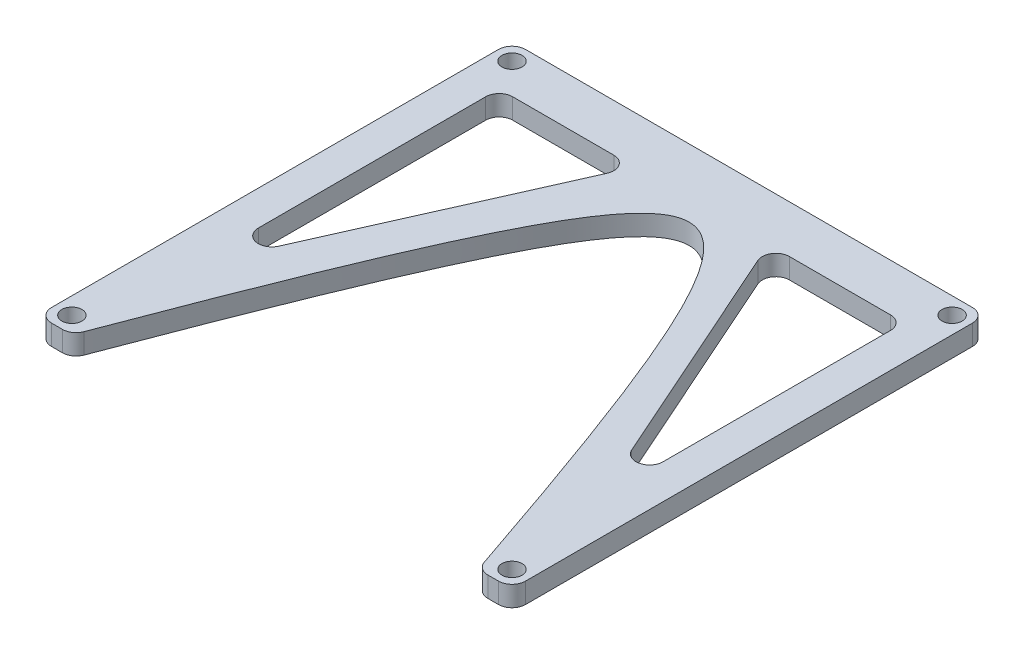
ISO-10303-21;
HEADER;
FILE_DESCRIPTION(('STEP AP214'),'2;1');
FILE_NAME('part.step','',(''),(''),'','','');
FILE_SCHEMA(('AUTOMOTIVE_DESIGN { 1 0 10303 214 1 1 1 1 }'));
ENDSEC;
DATA;
#1=APPLICATION_CONTEXT('core data for automotive mechanical design processes');
#2=APPLICATION_PROTOCOL_DEFINITION('international standard','automotive_design',2000,#1);
#3=PRODUCT_CONTEXT('',#1,'mechanical');
#4=PRODUCT('Part','Part','',(#3));
#5=PRODUCT_RELATED_PRODUCT_CATEGORY('part','',(#4));
#6=PRODUCT_DEFINITION_FORMATION('','',#4);
#7=PRODUCT_DEFINITION_CONTEXT('part definition',#1,'design');
#8=PRODUCT_DEFINITION('design','',#6,#7);
#9=PRODUCT_DEFINITION_SHAPE('','',#8);
#10=(LENGTH_UNIT() NAMED_UNIT(*) SI_UNIT(.MILLI.,.METRE.));
#11=(NAMED_UNIT(*) PLANE_ANGLE_UNIT() SI_UNIT($,.RADIAN.));
#12=(NAMED_UNIT(*) SI_UNIT($,.STERADIAN.) SOLID_ANGLE_UNIT());
#13=UNCERTAINTY_MEASURE_WITH_UNIT(LENGTH_MEASURE(1.E-05),#10,'distance_accuracy_value','');
#14=(GEOMETRIC_REPRESENTATION_CONTEXT(3) GLOBAL_UNCERTAINTY_ASSIGNED_CONTEXT((#13)) GLOBAL_UNIT_ASSIGNED_CONTEXT((#10,
#11,#12)) REPRESENTATION_CONTEXT('',''));
#15=CARTESIAN_POINT('',(0.,0.,0.));
#16=DIRECTION('',(0.,0.,1.));
#17=DIRECTION('',(1.,0.,0.));
#18=AXIS2_PLACEMENT_3D('',#15,#16,#17);
#19=CARTESIAN_POINT('',(35.,3.,35.));
#20=DIRECTION('',(0.,0.,-1.));
#21=DIRECTION('',(-1.,0.,0.));
#22=AXIS2_PLACEMENT_3D('',#19,#20,#21);
#23=PLANE('',#22);
#24=DIRECTION('',(1.,0.,0.));
#25=VECTOR('',#24,1.);
#26=CARTESIAN_POINT('',(35.,0.,35.));
#27=LINE('',#26,#25);
#28=CARTESIAN_POINT('',(31.4350308170845,0.,35.));
#29=VERTEX_POINT('',#28);
#30=CARTESIAN_POINT('',(33.,0.,35.));
#31=VERTEX_POINT('',#30);
#32=EDGE_CURVE('E234',#29,#31,#27,.T.);
#33=ORIENTED_EDGE('',*,*,#32,.T.);
#34=DIRECTION('',(0.,-1.,0.));
#35=VECTOR('',#34,1.);
#36=CARTESIAN_POINT('',(33.,3.,35.));
#37=LINE('',#36,#35);
#38=CARTESIAN_POINT('',(33.,3.,35.));
#39=VERTEX_POINT('',#38);
#40=EDGE_CURVE('E212',#31,#39,#37,.F.);
#41=ORIENTED_EDGE('',*,*,#40,.T.);
#42=DIRECTION('',(1.,0.,0.));
#43=VECTOR('',#42,1.);
#44=CARTESIAN_POINT('',(35.,3.,35.));
#45=LINE('',#44,#43);
#46=CARTESIAN_POINT('',(31.4350308170845,3.,35.));
#47=VERTEX_POINT('',#46);
#48=EDGE_CURVE('E253',#47,#39,#45,.T.);
#49=ORIENTED_EDGE('',*,*,#48,.F.);
#50=DIRECTION('',(0.,-1.,0.));
#51=VECTOR('',#50,1.);
#52=CARTESIAN_POINT('',(31.4350308170845,3.,35.));
#53=LINE('',#52,#51);
#54=EDGE_CURVE('E217',#47,#29,#53,.T.);
#55=ORIENTED_EDGE('',*,*,#54,.T.);
#56=EDGE_LOOP('',(#33,#41,#49,#55));
#57=FACE_BOUND('',#56,.T.);
#58=ADVANCED_FACE('F46',(#57),#23,.F.);
#59=CARTESIAN_POINT('',(35.,3.,-35.));
#60=DIRECTION('',(-1.,0.,0.));
#61=DIRECTION('',(0.,0.,1.));
#62=AXIS2_PLACEMENT_3D('',#59,#60,#61);
#63=PLANE('',#62);
#64=DIRECTION('',(0.,0.,-1.));
#65=VECTOR('',#64,1.);
#66=CARTESIAN_POINT('',(35.,3.,-35.));
#67=LINE('',#66,#65);
#68=CARTESIAN_POINT('',(35.,3.,33.));
#69=VERTEX_POINT('',#68);
#70=CARTESIAN_POINT('',(35.,3.,-33.));
#71=VERTEX_POINT('',#70);
#72=EDGE_CURVE('E227',#69,#71,#67,.T.);
#73=ORIENTED_EDGE('',*,*,#72,.F.);
#74=DIRECTION('',(0.,-1.,0.));
#75=VECTOR('',#74,1.);
#76=CARTESIAN_POINT('',(35.,3.,33.));
#77=LINE('',#76,#75);
#78=CARTESIAN_POINT('',(35.,0.,33.));
#79=VERTEX_POINT('',#78);
#80=EDGE_CURVE('E211',#69,#79,#77,.T.);
#81=ORIENTED_EDGE('',*,*,#80,.T.);
#82=DIRECTION('',(0.,0.,-1.));
#83=VECTOR('',#82,1.);
#84=CARTESIAN_POINT('',(35.,0.,-35.));
#85=LINE('',#84,#83);
#86=CARTESIAN_POINT('',(35.,0.,-33.));
#87=VERTEX_POINT('',#86);
#88=EDGE_CURVE('E224',#79,#87,#85,.T.);
#89=ORIENTED_EDGE('',*,*,#88,.T.);
#90=DIRECTION('',(0.,-1.,0.));
#91=VECTOR('',#90,1.);
#92=CARTESIAN_POINT('',(35.,3.,-33.));
#93=LINE('',#92,#91);
#94=EDGE_CURVE('E229',#87,#71,#93,.F.);
#95=ORIENTED_EDGE('',*,*,#94,.T.);
#96=EDGE_LOOP('',(#73,#81,#89,#95));
#97=FACE_BOUND('',#96,.T.);
#98=ADVANCED_FACE('F223',(#97),#63,.F.);
#99=CARTESIAN_POINT('',(-35.,3.,-35.));
#100=DIRECTION('',(0.,0.,1.));
#101=DIRECTION('',(1.,0.,0.));
#102=AXIS2_PLACEMENT_3D('',#99,#100,#101);
#103=PLANE('',#102);
#104=DIRECTION('',(-1.,0.,0.));
#105=VECTOR('',#104,1.);
#106=CARTESIAN_POINT('',(-35.,0.,-35.));
#107=LINE('',#106,#105);
#108=CARTESIAN_POINT('',(33.,0.,-35.));
#109=VERTEX_POINT('',#108);
#110=CARTESIAN_POINT('',(-33.,0.,-35.));
#111=VERTEX_POINT('',#110);
#112=EDGE_CURVE('E233',#109,#111,#107,.T.);
#113=ORIENTED_EDGE('',*,*,#112,.T.);
#114=DIRECTION('',(0.,-1.,0.));
#115=VECTOR('',#114,1.);
#116=CARTESIAN_POINT('',(-33.,3.,-35.));
#117=LINE('',#116,#115);
#118=CARTESIAN_POINT('',(-33.,3.,-35.));
#119=VERTEX_POINT('',#118);
#120=EDGE_CURVE('E300',#111,#119,#117,.F.);
#121=ORIENTED_EDGE('',*,*,#120,.T.);
#122=DIRECTION('',(-1.,0.,0.));
#123=VECTOR('',#122,1.);
#124=CARTESIAN_POINT('',(-35.,3.,-35.));
#125=LINE('',#124,#123);
#126=CARTESIAN_POINT('',(33.,3.,-35.));
#127=VERTEX_POINT('',#126);
#128=EDGE_CURVE('E424',#127,#119,#125,.T.);
#129=ORIENTED_EDGE('',*,*,#128,.F.);
#130=DIRECTION('',(0.,-1.,0.));
#131=VECTOR('',#130,1.);
#132=CARTESIAN_POINT('',(33.,3.,-35.));
#133=LINE('',#132,#131);
#134=EDGE_CURVE('E297',#127,#109,#133,.T.);
#135=ORIENTED_EDGE('',*,*,#134,.T.);
#136=EDGE_LOOP('',(#113,#121,#129,#135));
#137=FACE_BOUND('',#136,.T.);
#138=ADVANCED_FACE('F453',(#137),#103,.F.);
#139=CARTESIAN_POINT('',(-35.,3.,-35.));
#140=DIRECTION('',(1.,0.,0.));
#141=DIRECTION('',(0.,0.,-1.));
#142=AXIS2_PLACEMENT_3D('',#139,#140,#141);
#143=PLANE('',#142);
#144=DIRECTION('',(0.,0.,1.));
#145=VECTOR('',#144,1.);
#146=CARTESIAN_POINT('',(-35.,0.,-35.));
#147=LINE('',#146,#145);
#148=CARTESIAN_POINT('',(-35.,0.,-33.));
#149=VERTEX_POINT('',#148);
#150=CARTESIAN_POINT('',(-35.,0.,33.));
#151=VERTEX_POINT('',#150);
#152=EDGE_CURVE('E237',#149,#151,#147,.T.);
#153=ORIENTED_EDGE('',*,*,#152,.T.);
#154=DIRECTION('',(0.,-1.,0.));
#155=VECTOR('',#154,1.);
#156=CARTESIAN_POINT('',(-35.,3.,33.));
#157=LINE('',#156,#155);
#158=CARTESIAN_POINT('',(-35.,3.,33.));
#159=VERTEX_POINT('',#158);
#160=EDGE_CURVE('E295',#151,#159,#157,.F.);
#161=ORIENTED_EDGE('',*,*,#160,.T.);
#162=DIRECTION('',(0.,0.,1.));
#163=VECTOR('',#162,1.);
#164=CARTESIAN_POINT('',(-35.,3.,-35.));
#165=LINE('',#164,#163);
#166=CARTESIAN_POINT('',(-35.,3.,-33.));
#167=VERTEX_POINT('',#166);
#168=EDGE_CURVE('E427',#167,#159,#165,.T.);
#169=ORIENTED_EDGE('',*,*,#168,.F.);
#170=DIRECTION('',(0.,-1.,0.));
#171=VECTOR('',#170,1.);
#172=CARTESIAN_POINT('',(-35.,3.,-33.));
#173=LINE('',#172,#171);
#174=EDGE_CURVE('E292',#167,#149,#173,.T.);
#175=ORIENTED_EDGE('',*,*,#174,.T.);
#176=EDGE_LOOP('',(#153,#161,#169,#175));
#177=FACE_BOUND('',#176,.T.);
#178=ADVANCED_FACE('F449',(#177),#143,.F.);
#179=CARTESIAN_POINT('',(-30.,3.,35.));
#180=DIRECTION('',(0.,0.,-1.));
#181=DIRECTION('',(-1.,0.,0.));
#182=AXIS2_PLACEMENT_3D('',#179,#180,#181);
#183=PLANE('',#182);
#184=DIRECTION('',(1.,0.,0.));
#185=VECTOR('',#184,1.);
#186=CARTESIAN_POINT('',(-30.,0.,35.));
#187=LINE('',#186,#185);
#188=CARTESIAN_POINT('',(-33.,0.,35.));
#189=VERTEX_POINT('',#188);
#190=CARTESIAN_POINT('',(-31.3843816511325,0.,35.));
#191=VERTEX_POINT('',#190);
#192=EDGE_CURVE('E245',#189,#191,#187,.T.);
#193=ORIENTED_EDGE('',*,*,#192,.T.);
#194=DIRECTION('',(0.,-1.,0.));
#195=VECTOR('',#194,1.);
#196=CARTESIAN_POINT('',(-31.3843816511325,3.,35.));
#197=LINE('',#196,#195);
#198=CARTESIAN_POINT('',(-31.3843816511325,3.,35.));
#199=VERTEX_POINT('',#198);
#200=EDGE_CURVE('E290',#191,#199,#197,.F.);
#201=ORIENTED_EDGE('',*,*,#200,.T.);
#202=DIRECTION('',(1.,0.,0.));
#203=VECTOR('',#202,1.);
#204=CARTESIAN_POINT('',(-30.,3.,35.));
#205=LINE('',#204,#203);
#206=CARTESIAN_POINT('',(-33.,3.,35.));
#207=VERTEX_POINT('',#206);
#208=EDGE_CURVE('E430',#207,#199,#205,.T.);
#209=ORIENTED_EDGE('',*,*,#208,.F.);
#210=DIRECTION('',(0.,-1.,0.));
#211=VECTOR('',#210,1.);
#212=CARTESIAN_POINT('',(-33.,3.,35.));
#213=LINE('',#212,#211);
#214=EDGE_CURVE('E287',#207,#189,#213,.T.);
#215=ORIENTED_EDGE('',*,*,#214,.T.);
#216=EDGE_LOOP('',(#193,#201,#209,#215));
#217=FACE_BOUND('',#216,.T.);
#218=ADVANCED_FACE('F444',(#217),#183,.F.);
#219=CARTESIAN_POINT('',(-30.,3.,35.));
#220=CARTESIAN_POINT('',(1.60550394840413,3.,-49.1022537390841));
#221=CARTESIAN_POINT('',(30.,3.,35.));
#222=(BOUNDED_CURVE() B_SPLINE_CURVE(2,(#219,#220,#221),.UNSPECIFIED.,.F.,
.F.) B_SPLINE_CURVE_WITH_KNOTS((3,3),(0.,1.),
.UNSPECIFIED.) CURVE() GEOMETRIC_REPRESENTATION_ITEM() RATIONAL_B_SPLINE_CURVE((1.,
2.48939375751008,1.)) REPRESENTATION_ITEM(''));
#223=DIRECTION('',(0.,-1.,0.));
#224=VECTOR('',#223,1.);
#225=SURFACE_OF_LINEAR_EXTRUSION('',#222,#224);
#226=CARTESIAN_POINT('',(-30.,0.,35.));
#227=CARTESIAN_POINT('',(1.60550394840413,0.,-49.1022537390841));
#228=CARTESIAN_POINT('',(30.,0.,35.));
#229=(BOUNDED_CURVE() B_SPLINE_CURVE(2,(#226,#227,#228),.UNSPECIFIED.,.F.,
.F.) B_SPLINE_CURVE_WITH_KNOTS((3,3),(0.,1.),
.UNSPECIFIED.) CURVE() GEOMETRIC_REPRESENTATION_ITEM() RATIONAL_B_SPLINE_CURVE((1.,
2.48939375751008,1.)) REPRESENTATION_ITEM(''));
#230=CARTESIAN_POINT('',(-29.5127749674468,0.,33.7050449784112));
#231=VERTEX_POINT('',#230);
#232=CARTESIAN_POINT('',(29.5406622231484,0.,33.6413794744989));
#233=VERTEX_POINT('',#232);
#234=EDGE_CURVE('E248',#231,#233,#229,.T.);
#235=ORIENTED_EDGE('',*,*,#234,.T.);
#236=DIRECTION('',(0.,-1.,0.));
#237=VECTOR('',#236,1.);
#238=CARTESIAN_POINT('',(29.5406622231484,0.,33.6413794744989));
#239=LINE('',#238,#237);
#240=CARTESIAN_POINT('',(29.5406622231483,3.,33.6413794744988));
#241=VERTEX_POINT('',#240);
#242=EDGE_CURVE('E285',#233,#241,#239,.F.);
#243=ORIENTED_EDGE('',*,*,#242,.T.);
#244=CARTESIAN_POINT('',(-29.5127749674468,3.,33.7050449784112));
#245=VERTEX_POINT('',#244);
#246=EDGE_CURVE('E257',#245,#241,#222,.T.);
#247=ORIENTED_EDGE('',*,*,#246,.F.);
#248=DIRECTION('',(0.,-1.,0.));
#249=VECTOR('',#248,1.);
#250=CARTESIAN_POINT('',(-29.5127749674468,3.,33.7050449784112));
#251=LINE('',#250,#249);
#252=EDGE_CURVE('E282',#245,#231,#251,.T.);
#253=ORIENTED_EDGE('',*,*,#252,.T.);
#254=EDGE_LOOP('',(#235,#243,#247,#253));
#255=FACE_BOUND('',#254,.T.);
#256=ADVANCED_FACE('F440',(#255),#225,.F.);
#257=CARTESIAN_POINT('',(1.14539423881671,3.,-25.));
#258=DIRECTION('',(0.,1.,0.));
#259=DIRECTION('',(0.,0.,1.));
#260=AXIS2_PLACEMENT_3D('',#257,#258,#259);
#261=PLANE('',#260);
#262=DIRECTION('',(0.406138466053448,0.,-0.913811548620257));
#263=VECTOR('',#262,1.);
#264=CARTESIAN_POINT('',(-9.89161932674733,3.,-28.));
#265=LINE('',#264,#263);
#266=CARTESIAN_POINT('',(-26.0639962295068,3.,8.38784803120884));
#267=VERTEX_POINT('',#266);
#268=CARTESIAN_POINT('',(-11.1415201854615,3.,-25.1877230678931));
#269=VERTEX_POINT('',#268);
#270=EDGE_CURVE('E356',#267,#269,#265,.T.);
#271=ORIENTED_EDGE('',*,*,#270,.F.);
#272=CARTESIAN_POINT('',(-27.8916193267473,3.,7.57557109910195));
#273=DIRECTION('',(0.,1.,0.));
#274=DIRECTION('',(0.,0.,1.));
#275=AXIS2_PLACEMENT_3D('',#272,#273,#274);
#276=CIRCLE('',#275,2.);
#277=CARTESIAN_POINT('',(-29.8916193267473,3.,7.57557109910195));
#278=VERTEX_POINT('',#277);
#279=EDGE_CURVE('E343',#267,#278,#276,.F.);
#280=ORIENTED_EDGE('',*,*,#279,.T.);
#281=DIRECTION('',(0.,0.,1.));
#282=VECTOR('',#281,1.);
#283=CARTESIAN_POINT('',(-29.8916193267473,3.,17.));
#284=LINE('',#283,#282);
#285=CARTESIAN_POINT('',(-29.8916193267473,3.,-26.));
#286=VERTEX_POINT('',#285);
#287=EDGE_CURVE('E376',#286,#278,#284,.T.);
#288=ORIENTED_EDGE('',*,*,#287,.F.);
#289=CARTESIAN_POINT('',(-27.8916193267473,3.,-26.));
#290=DIRECTION('',(0.,1.,0.));
#291=DIRECTION('',(0.,0.,1.));
#292=AXIS2_PLACEMENT_3D('',#289,#290,#291);
#293=CIRCLE('',#292,2.);
#294=CARTESIAN_POINT('',(-27.8916193267473,3.,-28.));
#295=VERTEX_POINT('',#294);
#296=EDGE_CURVE('E347',#286,#295,#293,.F.);
#297=ORIENTED_EDGE('',*,*,#296,.T.);
#298=DIRECTION('',(-1.,0.,0.));
#299=VECTOR('',#298,1.);
#300=CARTESIAN_POINT('',(-29.8916193267473,3.,-28.));
#301=LINE('',#300,#299);
#302=CARTESIAN_POINT('',(-12.969143282702,3.,-28.));
#303=VERTEX_POINT('',#302);
#304=EDGE_CURVE('E357',#303,#295,#301,.T.);
#305=ORIENTED_EDGE('',*,*,#304,.F.);
#306=CARTESIAN_POINT('',(-12.969143282702,3.,-26.));
#307=DIRECTION('',(0.,1.,0.));
#308=DIRECTION('',(0.,0.,1.));
#309=AXIS2_PLACEMENT_3D('',#306,#307,#308);
#310=CIRCLE('',#309,2.);
#311=EDGE_CURVE('E54',#303,#269,#310,.F.);
#312=ORIENTED_EDGE('',*,*,#311,.T.);
#313=EDGE_LOOP('',(#271,#280,#288,#297,#305,#312));
#314=FACE_BOUND('',#313,.T.);
#315=DIRECTION('',(0.406138466053448,0.,0.913811548620257));
#316=VECTOR('',#315,1.);
#317=CARTESIAN_POINT('',(9.89161932674734,3.,-28.));
#318=LINE('',#317,#316);
#319=CARTESIAN_POINT('',(11.1415201854615,3.,-25.1877230678931));
#320=VERTEX_POINT('',#319);
#321=CARTESIAN_POINT('',(26.0639962295068,3.,8.38784803120883));
#322=VERTEX_POINT('',#321);
#323=EDGE_CURVE('E391',#320,#322,#318,.T.);
#324=ORIENTED_EDGE('',*,*,#323,.F.);
#325=CARTESIAN_POINT('',(12.969143282702,3.,-26.));
#326=DIRECTION('',(0.,1.,0.));
#327=DIRECTION('',(0.,0.,1.));
#328=AXIS2_PLACEMENT_3D('',#325,#326,#327);
#329=CIRCLE('',#328,2.);
#330=CARTESIAN_POINT('',(12.969143282702,3.,-28.));
#331=VERTEX_POINT('',#330);
#332=EDGE_CURVE('E335',#320,#331,#329,.F.);
#333=ORIENTED_EDGE('',*,*,#332,.T.);
#334=DIRECTION('',(-1.,0.,0.));
#335=VECTOR('',#334,1.);
#336=CARTESIAN_POINT('',(29.8916193267473,3.,-28.));
#337=LINE('',#336,#335);
#338=CARTESIAN_POINT('',(27.8916193267473,3.,-28.));
#339=VERTEX_POINT('',#338);
#340=EDGE_CURVE('E386',#339,#331,#337,.T.);
#341=ORIENTED_EDGE('',*,*,#340,.F.);
#342=CARTESIAN_POINT('',(27.8916193267473,3.,-26.));
#343=DIRECTION('',(0.,1.,0.));
#344=DIRECTION('',(0.,0.,1.));
#345=AXIS2_PLACEMENT_3D('',#342,#343,#344);
#346=CIRCLE('',#345,2.);
#347=CARTESIAN_POINT('',(29.8916193267473,3.,-26.));
#348=VERTEX_POINT('',#347);
#349=EDGE_CURVE('E331',#339,#348,#346,.F.);
#350=ORIENTED_EDGE('',*,*,#349,.T.);
#351=DIRECTION('',(0.,0.,-1.));
#352=VECTOR('',#351,1.);
#353=CARTESIAN_POINT('',(29.8916193267473,3.,17.));
#354=LINE('',#353,#352);
#355=CARTESIAN_POINT('',(29.8916193267473,3.,7.57557109910194));
#356=VERTEX_POINT('',#355);
#357=EDGE_CURVE('E394',#356,#348,#354,.T.);
#358=ORIENTED_EDGE('',*,*,#357,.F.);
#359=CARTESIAN_POINT('',(27.8916193267473,3.,7.57557109910193));
#360=DIRECTION('',(0.,1.,0.));
#361=DIRECTION('',(0.,0.,1.));
#362=AXIS2_PLACEMENT_3D('',#359,#360,#361);
#363=CIRCLE('',#362,2.);
#364=EDGE_CURVE('E339',#356,#322,#363,.F.);
#365=ORIENTED_EDGE('',*,*,#364,.T.);
#366=EDGE_LOOP('',(#324,#333,#341,#350,#358,#365));
#367=FACE_BOUND('',#366,.T.);
#368=CARTESIAN_POINT('',(-32.4999999999993,3.,32.5));
#369=DIRECTION('',(0.,1.,0.));
#370=DIRECTION('',(0.,0.,1.));
#371=AXIS2_PLACEMENT_3D('',#368,#369,#370);
#372=CIRCLE('',#371,1.48813384559825);
#373=CARTESIAN_POINT('',(-32.4999999999993,3.,33.9881338455983));
#374=VERTEX_POINT('',#373);
#375=EDGE_CURVE('E374',#374,#374,#372,.T.);
#376=ORIENTED_EDGE('',*,*,#375,.F.);
#377=EDGE_LOOP('',(#376));
#378=FACE_BOUND('',#377,.T.);
#379=CARTESIAN_POINT('',(32.5000000000007,3.,32.5));
#380=DIRECTION('',(0.,1.,0.));
#381=DIRECTION('',(0.,0.,1.));
#382=AXIS2_PLACEMENT_3D('',#379,#380,#381);
#383=CIRCLE('',#382,1.48813384559825);
#384=CARTESIAN_POINT('',(32.5000000000007,3.,33.9881338455983));
#385=VERTEX_POINT('',#384);
#386=EDGE_CURVE('E409',#385,#385,#383,.T.);
#387=ORIENTED_EDGE('',*,*,#386,.F.);
#388=EDGE_LOOP('',(#387));
#389=FACE_BOUND('',#388,.T.);
#390=CARTESIAN_POINT('',(32.5,3.,-32.5));
#391=DIRECTION('',(0.,1.,0.));
#392=DIRECTION('',(0.,0.,1.));
#393=AXIS2_PLACEMENT_3D('',#390,#391,#392);
#394=CIRCLE('',#393,1.48813384559825);
#395=CARTESIAN_POINT('',(32.5,3.,-31.0118661544018));
#396=VERTEX_POINT('',#395);
#397=EDGE_CURVE('E403',#396,#396,#394,.T.);
#398=ORIENTED_EDGE('',*,*,#397,.F.);
#399=EDGE_LOOP('',(#398));
#400=FACE_BOUND('',#399,.T.);
#401=CARTESIAN_POINT('',(-32.5,3.,-32.5));
#402=DIRECTION('',(0.,1.,0.));
#403=DIRECTION('',(0.,0.,1.));
#404=AXIS2_PLACEMENT_3D('',#401,#402,#403);
#405=CIRCLE('',#404,1.48813384559825);
#406=CARTESIAN_POINT('',(-32.5,3.,-31.0118661544018));
#407=VERTEX_POINT('',#406);
#408=EDGE_CURVE('E402',#407,#407,#405,.T.);
#409=ORIENTED_EDGE('',*,*,#408,.F.);
#410=EDGE_LOOP('',(#409));
#411=FACE_BOUND('',#410,.T.);
#412=ORIENTED_EDGE('',*,*,#48,.T.);
#413=CARTESIAN_POINT('',(33.,3.,33.));
#414=DIRECTION('',(0.,1.,0.));
#415=DIRECTION('',(0.,0.,1.));
#416=AXIS2_PLACEMENT_3D('',#413,#414,#415);
#417=CIRCLE('',#416,2.);
#418=EDGE_CURVE('E280',#39,#69,#417,.T.);
#419=ORIENTED_EDGE('',*,*,#418,.T.);
#420=ORIENTED_EDGE('',*,*,#72,.T.);
#421=CARTESIAN_POINT('',(33.,3.,-33.));
#422=DIRECTION('',(0.,1.,0.));
#423=DIRECTION('',(0.,0.,1.));
#424=AXIS2_PLACEMENT_3D('',#421,#422,#423);
#425=CIRCLE('',#424,2.);
#426=EDGE_CURVE('E270',#71,#127,#425,.T.);
#427=ORIENTED_EDGE('',*,*,#426,.T.);
#428=ORIENTED_EDGE('',*,*,#128,.T.);
#429=CARTESIAN_POINT('',(-33.,3.,-33.));
#430=DIRECTION('',(0.,1.,0.));
#431=DIRECTION('',(0.,0.,1.));
#432=AXIS2_PLACEMENT_3D('',#429,#430,#431);
#433=CIRCLE('',#432,2.);
#434=EDGE_CURVE('E272',#119,#167,#433,.T.);
#435=ORIENTED_EDGE('',*,*,#434,.T.);
#436=ORIENTED_EDGE('',*,*,#168,.T.);
#437=CARTESIAN_POINT('',(-33.,3.,33.));
#438=DIRECTION('',(0.,1.,0.));
#439=DIRECTION('',(0.,0.,1.));
#440=AXIS2_PLACEMENT_3D('',#437,#438,#439);
#441=CIRCLE('',#440,2.);
#442=EDGE_CURVE('E274',#159,#207,#441,.T.);
#443=ORIENTED_EDGE('',*,*,#442,.T.);
#444=ORIENTED_EDGE('',*,*,#208,.T.);
#445=CARTESIAN_POINT('',(-31.3843816511325,3.,33.));
#446=DIRECTION('',(0.,1.,0.));
#447=DIRECTION('',(0.,0.,1.));
#448=AXIS2_PLACEMENT_3D('',#445,#446,#447);
#449=CIRCLE('',#448,2.);
#450=EDGE_CURVE('E276',#199,#245,#449,.T.);
#451=ORIENTED_EDGE('',*,*,#450,.T.);
#452=ORIENTED_EDGE('',*,*,#246,.T.);
#453=CARTESIAN_POINT('',(31.4350308170845,3.,33.));
#454=DIRECTION('',(0.,1.,0.));
#455=DIRECTION('',(0.,0.,1.));
#456=AXIS2_PLACEMENT_3D('',#453,#454,#455);
#457=CIRCLE('',#456,2.);
#458=EDGE_CURVE('E278',#241,#47,#457,.T.);
#459=ORIENTED_EDGE('',*,*,#458,.T.);
#460=EDGE_LOOP('',(#412,#419,#420,#427,#428,#435,#436,#443,#444,#451,#452,#459));
#461=FACE_BOUND('',#460,.T.);
#462=ADVANCED_FACE('F354',(#314,#367,#378,#389,#400,#411,#461),#261,.T.);
#463=CARTESIAN_POINT('',(1.14539423881671,0.,-25.));
#464=DIRECTION('',(0.,1.,0.));
#465=DIRECTION('',(0.,0.,1.));
#466=AXIS2_PLACEMENT_3D('',#463,#464,#465);
#467=PLANE('',#466);
#468=DIRECTION('',(-1.,0.,0.));
#469=VECTOR('',#468,1.);
#470=CARTESIAN_POINT('',(-29.8916193267473,0.,-28.));
#471=LINE('',#470,#469);
#472=CARTESIAN_POINT('',(-12.969143282702,0.,-28.));
#473=VERTEX_POINT('',#472);
#474=CARTESIAN_POINT('',(-27.8916193267473,0.,-28.));
#475=VERTEX_POINT('',#474);
#476=EDGE_CURVE('E368',#473,#475,#471,.T.);
#477=ORIENTED_EDGE('',*,*,#476,.T.);
#478=CARTESIAN_POINT('',(-27.8916193267473,0.,-26.));
#479=DIRECTION('',(0.,1.,0.));
#480=DIRECTION('',(0.,0.,1.));
#481=AXIS2_PLACEMENT_3D('',#478,#479,#480);
#482=CIRCLE('',#481,2.);
#483=CARTESIAN_POINT('',(-29.8916193267473,0.,-26.));
#484=VERTEX_POINT('',#483);
#485=EDGE_CURVE('E349',#475,#484,#482,.T.);
#486=ORIENTED_EDGE('',*,*,#485,.T.);
#487=DIRECTION('',(0.,0.,1.));
#488=VECTOR('',#487,1.);
#489=CARTESIAN_POINT('',(-29.8916193267473,0.,17.));
#490=LINE('',#489,#488);
#491=CARTESIAN_POINT('',(-29.8916193267473,0.,7.57557109910195));
#492=VERTEX_POINT('',#491);
#493=EDGE_CURVE('E370',#484,#492,#490,.T.);
#494=ORIENTED_EDGE('',*,*,#493,.T.);
#495=CARTESIAN_POINT('',(-27.8916193267473,0.,7.57557109910195));
#496=DIRECTION('',(0.,1.,0.));
#497=DIRECTION('',(0.,0.,1.));
#498=AXIS2_PLACEMENT_3D('',#495,#496,#497);
#499=CIRCLE('',#498,2.);
#500=CARTESIAN_POINT('',(-26.0639962295068,0.,8.38784803120884));
#501=VERTEX_POINT('',#500);
#502=EDGE_CURVE('E345',#492,#501,#499,.T.);
#503=ORIENTED_EDGE('',*,*,#502,.T.);
#504=DIRECTION('',(0.406138466053448,0.,-0.913811548620257));
#505=VECTOR('',#504,1.);
#506=CARTESIAN_POINT('',(-9.89161932674733,0.,-28.));
#507=LINE('',#506,#505);
#508=CARTESIAN_POINT('',(-11.1415201854615,0.,-25.1877230678931));
#509=VERTEX_POINT('',#508);
#510=EDGE_CURVE('E371',#501,#509,#507,.T.);
#511=ORIENTED_EDGE('',*,*,#510,.T.);
#512=CARTESIAN_POINT('',(-12.969143282702,0.,-26.));
#513=DIRECTION('',(0.,1.,0.));
#514=DIRECTION('',(0.,0.,1.));
#515=AXIS2_PLACEMENT_3D('',#512,#513,#514);
#516=CIRCLE('',#515,2.);
#517=EDGE_CURVE('E13',#509,#473,#516,.T.);
#518=ORIENTED_EDGE('',*,*,#517,.T.);
#519=EDGE_LOOP('',(#477,#486,#494,#503,#511,#518));
#520=FACE_BOUND('',#519,.T.);
#521=DIRECTION('',(0.,0.,-1.));
#522=VECTOR('',#521,1.);
#523=CARTESIAN_POINT('',(29.8916193267473,0.,17.));
#524=LINE('',#523,#522);
#525=CARTESIAN_POINT('',(29.8916193267473,0.,7.57557109910194));
#526=VERTEX_POINT('',#525);
#527=CARTESIAN_POINT('',(29.8916193267473,0.,-26.));
#528=VERTEX_POINT('',#527);
#529=EDGE_CURVE('E385',#526,#528,#524,.T.);
#530=ORIENTED_EDGE('',*,*,#529,.T.);
#531=CARTESIAN_POINT('',(27.8916193267473,0.,-26.));
#532=DIRECTION('',(0.,1.,0.));
#533=DIRECTION('',(0.,0.,1.));
#534=AXIS2_PLACEMENT_3D('',#531,#532,#533);
#535=CIRCLE('',#534,2.);
#536=CARTESIAN_POINT('',(27.8916193267473,0.,-28.));
#537=VERTEX_POINT('',#536);
#538=EDGE_CURVE('E333',#528,#537,#535,.T.);
#539=ORIENTED_EDGE('',*,*,#538,.T.);
#540=DIRECTION('',(-1.,0.,0.));
#541=VECTOR('',#540,1.);
#542=CARTESIAN_POINT('',(29.8916193267473,0.,-28.));
#543=LINE('',#542,#541);
#544=CARTESIAN_POINT('',(12.969143282702,0.,-28.));
#545=VERTEX_POINT('',#544);
#546=EDGE_CURVE('E365',#537,#545,#543,.T.);
#547=ORIENTED_EDGE('',*,*,#546,.T.);
#548=CARTESIAN_POINT('',(12.969143282702,0.,-26.));
#549=DIRECTION('',(0.,1.,0.));
#550=DIRECTION('',(0.,0.,1.));
#551=AXIS2_PLACEMENT_3D('',#548,#549,#550);
#552=CIRCLE('',#551,2.);
#553=CARTESIAN_POINT('',(11.1415201854615,0.,-25.1877230678931));
#554=VERTEX_POINT('',#553);
#555=EDGE_CURVE('E337',#545,#554,#552,.T.);
#556=ORIENTED_EDGE('',*,*,#555,.T.);
#557=DIRECTION('',(0.406138466053448,0.,0.913811548620257));
#558=VECTOR('',#557,1.);
#559=CARTESIAN_POINT('',(9.89161932674734,0.,-28.));
#560=LINE('',#559,#558);
#561=CARTESIAN_POINT('',(26.0639962295068,0.,8.38784803120883));
#562=VERTEX_POINT('',#561);
#563=EDGE_CURVE('E382',#554,#562,#560,.T.);
#564=ORIENTED_EDGE('',*,*,#563,.T.);
#565=CARTESIAN_POINT('',(27.8916193267473,0.,7.57557109910193));
#566=DIRECTION('',(0.,1.,0.));
#567=DIRECTION('',(0.,0.,1.));
#568=AXIS2_PLACEMENT_3D('',#565,#566,#567);
#569=CIRCLE('',#568,2.);
#570=EDGE_CURVE('E341',#562,#526,#569,.T.);
#571=ORIENTED_EDGE('',*,*,#570,.T.);
#572=EDGE_LOOP('',(#530,#539,#547,#556,#564,#571));
#573=FACE_BOUND('',#572,.T.);
#574=CARTESIAN_POINT('',(-32.4999999999993,0.,32.5));
#575=DIRECTION('',(0.,1.,0.));
#576=DIRECTION('',(0.,0.,1.));
#577=AXIS2_PLACEMENT_3D('',#574,#575,#576);
#578=CIRCLE('',#577,1.48813384559825);
#579=CARTESIAN_POINT('',(-32.4999999999993,0.,33.9881338455983));
#580=VERTEX_POINT('',#579);
#581=EDGE_CURVE('E412',#580,#580,#578,.T.);
#582=ORIENTED_EDGE('',*,*,#581,.T.);
#583=EDGE_LOOP('',(#582));
#584=FACE_BOUND('',#583,.T.);
#585=CARTESIAN_POINT('',(32.5000000000007,0.,32.5));
#586=DIRECTION('',(0.,1.,0.));
#587=DIRECTION('',(0.,0.,1.));
#588=AXIS2_PLACEMENT_3D('',#585,#586,#587);
#589=CIRCLE('',#588,1.48813384559825);
#590=CARTESIAN_POINT('',(32.5000000000007,0.,33.9881338455983));
#591=VERTEX_POINT('',#590);
#592=EDGE_CURVE('E406',#591,#591,#589,.T.);
#593=ORIENTED_EDGE('',*,*,#592,.T.);
#594=EDGE_LOOP('',(#593));
#595=FACE_BOUND('',#594,.T.);
#596=CARTESIAN_POINT('',(32.5,0.,-32.5));
#597=DIRECTION('',(0.,1.,0.));
#598=DIRECTION('',(0.,0.,1.));
#599=AXIS2_PLACEMENT_3D('',#596,#597,#598);
#600=CIRCLE('',#599,1.48813384559825);
#601=CARTESIAN_POINT('',(32.5,0.,-31.0118661544018));
#602=VERTEX_POINT('',#601);
#603=EDGE_CURVE('E399',#602,#602,#600,.T.);
#604=ORIENTED_EDGE('',*,*,#603,.T.);
#605=EDGE_LOOP('',(#604));
#606=FACE_BOUND('',#605,.T.);
#607=CARTESIAN_POINT('',(-32.5,0.,-32.5));
#608=DIRECTION('',(0.,1.,0.));
#609=DIRECTION('',(0.,0.,1.));
#610=AXIS2_PLACEMENT_3D('',#607,#608,#609);
#611=CIRCLE('',#610,1.48813384559825);
#612=CARTESIAN_POINT('',(-32.5,0.,-31.0118661544018));
#613=VERTEX_POINT('',#612);
#614=EDGE_CURVE('E239',#613,#613,#611,.T.);
#615=ORIENTED_EDGE('',*,*,#614,.T.);
#616=EDGE_LOOP('',(#615));
#617=FACE_BOUND('',#616,.T.);
#618=ORIENTED_EDGE('',*,*,#88,.F.);
#619=CARTESIAN_POINT('',(33.,0.,33.));
#620=DIRECTION('',(0.,1.,0.));
#621=DIRECTION('',(0.,0.,1.));
#622=AXIS2_PLACEMENT_3D('',#619,#620,#621);
#623=CIRCLE('',#622,2.);
#624=EDGE_CURVE('E207',#79,#31,#623,.F.);
#625=ORIENTED_EDGE('',*,*,#624,.T.);
#626=ORIENTED_EDGE('',*,*,#32,.F.);
#627=CARTESIAN_POINT('',(31.4350308170845,0.,33.));
#628=DIRECTION('',(0.,1.,0.));
#629=DIRECTION('',(0.,0.,1.));
#630=AXIS2_PLACEMENT_3D('',#627,#628,#629);
#631=CIRCLE('',#630,2.);
#632=EDGE_CURVE('E218',#29,#233,#631,.F.);
#633=ORIENTED_EDGE('',*,*,#632,.T.);
#634=ORIENTED_EDGE('',*,*,#234,.F.);
#635=CARTESIAN_POINT('',(-31.3843816511325,0.,33.));
#636=DIRECTION('',(0.,1.,0.));
#637=DIRECTION('',(0.,0.,1.));
#638=AXIS2_PLACEMENT_3D('',#635,#636,#637);
#639=CIRCLE('',#638,2.);
#640=EDGE_CURVE('E264',#231,#191,#639,.F.);
#641=ORIENTED_EDGE('',*,*,#640,.T.);
#642=ORIENTED_EDGE('',*,*,#192,.F.);
#643=CARTESIAN_POINT('',(-33.,0.,33.));
#644=DIRECTION('',(0.,1.,0.));
#645=DIRECTION('',(0.,0.,1.));
#646=AXIS2_PLACEMENT_3D('',#643,#644,#645);
#647=CIRCLE('',#646,2.);
#648=EDGE_CURVE('E262',#189,#151,#647,.F.);
#649=ORIENTED_EDGE('',*,*,#648,.T.);
#650=ORIENTED_EDGE('',*,*,#152,.F.);
#651=CARTESIAN_POINT('',(-33.,0.,-33.));
#652=DIRECTION('',(0.,1.,0.));
#653=DIRECTION('',(0.,0.,1.));
#654=AXIS2_PLACEMENT_3D('',#651,#652,#653);
#655=CIRCLE('',#654,2.);
#656=EDGE_CURVE('E260',#149,#111,#655,.F.);
#657=ORIENTED_EDGE('',*,*,#656,.T.);
#658=ORIENTED_EDGE('',*,*,#112,.F.);
#659=CARTESIAN_POINT('',(33.,0.,-33.));
#660=DIRECTION('',(0.,1.,0.));
#661=DIRECTION('',(0.,0.,1.));
#662=AXIS2_PLACEMENT_3D('',#659,#660,#661);
#663=CIRCLE('',#662,2.);
#664=EDGE_CURVE('E228',#109,#87,#663,.F.);
#665=ORIENTED_EDGE('',*,*,#664,.T.);
#666=EDGE_LOOP('',(#618,#625,#626,#633,#634,#641,#642,#649,#650,#657,#658,#665));
#667=FACE_BOUND('',#666,.T.);
#668=ADVANCED_FACE('F231',(#520,#573,#584,#595,#606,#617,#667),#467,.F.);
#669=CARTESIAN_POINT('',(-32.5,0.,-32.5));
#670=DIRECTION('',(0.,1.,0.));
#671=DIRECTION('',(0.,0.,1.));
#672=AXIS2_PLACEMENT_3D('',#669,#670,#671);
#673=CYLINDRICAL_SURFACE('',#672,1.48813384559825);
#674=ORIENTED_EDGE('',*,*,#614,.F.);
#675=EDGE_LOOP('',(#674));
#676=FACE_BOUND('',#675,.T.);
#677=ORIENTED_EDGE('',*,*,#408,.T.);
#678=EDGE_LOOP('',(#677));
#679=FACE_BOUND('',#678,.T.);
#680=ADVANCED_FACE('F540',(#676,#679),#673,.F.);
#681=CARTESIAN_POINT('',(32.5,0.,-32.5));
#682=DIRECTION('',(0.,1.,0.));
#683=DIRECTION('',(0.,0.,1.));
#684=AXIS2_PLACEMENT_3D('',#681,#682,#683);
#685=CYLINDRICAL_SURFACE('',#684,1.48813384559825);
#686=ORIENTED_EDGE('',*,*,#603,.F.);
#687=EDGE_LOOP('',(#686));
#688=FACE_BOUND('',#687,.T.);
#689=ORIENTED_EDGE('',*,*,#397,.T.);
#690=EDGE_LOOP('',(#689));
#691=FACE_BOUND('',#690,.T.);
#692=ADVANCED_FACE('F536',(#688,#691),#685,.F.);
#693=CARTESIAN_POINT('',(32.5000000000007,0.,32.5));
#694=DIRECTION('',(0.,1.,0.));
#695=DIRECTION('',(0.,0.,1.));
#696=AXIS2_PLACEMENT_3D('',#693,#694,#695);
#697=CYLINDRICAL_SURFACE('',#696,1.48813384559825);
#698=ORIENTED_EDGE('',*,*,#592,.F.);
#699=EDGE_LOOP('',(#698));
#700=FACE_BOUND('',#699,.T.);
#701=ORIENTED_EDGE('',*,*,#386,.T.);
#702=EDGE_LOOP('',(#701));
#703=FACE_BOUND('',#702,.T.);
#704=ADVANCED_FACE('F539',(#700,#703),#697,.F.);
#705=CARTESIAN_POINT('',(-32.4999999999993,0.,32.5));
#706=DIRECTION('',(0.,1.,0.));
#707=DIRECTION('',(0.,0.,1.));
#708=AXIS2_PLACEMENT_3D('',#705,#706,#707);
#709=CYLINDRICAL_SURFACE('',#708,1.48813384559825);
#710=ORIENTED_EDGE('',*,*,#581,.F.);
#711=EDGE_LOOP('',(#710));
#712=FACE_BOUND('',#711,.T.);
#713=ORIENTED_EDGE('',*,*,#375,.T.);
#714=EDGE_LOOP('',(#713));
#715=FACE_BOUND('',#714,.T.);
#716=ADVANCED_FACE('F466',(#712,#715),#709,.F.);
#717=CARTESIAN_POINT('',(33.,3.,33.));
#718=DIRECTION('',(0.,-1.,0.));
#719=DIRECTION('',(0.,0.,-1.));
#720=AXIS2_PLACEMENT_3D('',#717,#718,#719);
#721=CYLINDRICAL_SURFACE('',#720,2.);
#722=ORIENTED_EDGE('',*,*,#418,.F.);
#723=ORIENTED_EDGE('',*,*,#40,.F.);
#724=ORIENTED_EDGE('',*,*,#624,.F.);
#725=ORIENTED_EDGE('',*,*,#80,.F.);
#726=EDGE_LOOP('',(#722,#723,#724,#725));
#727=FACE_BOUND('',#726,.T.);
#728=ADVANCED_FACE('F210',(#727),#721,.T.);
#729=CARTESIAN_POINT('',(31.4350308170845,1.5,33.));
#730=DIRECTION('',(0.,-1.,0.));
#731=DIRECTION('',(0.,0.,-1.));
#732=AXIS2_PLACEMENT_3D('',#729,#730,#731);
#733=CYLINDRICAL_SURFACE('',#732,2.);
#734=ORIENTED_EDGE('',*,*,#458,.F.);
#735=ORIENTED_EDGE('',*,*,#242,.F.);
#736=ORIENTED_EDGE('',*,*,#632,.F.);
#737=ORIENTED_EDGE('',*,*,#54,.F.);
#738=EDGE_LOOP('',(#734,#735,#736,#737));
#739=FACE_BOUND('',#738,.T.);
#740=ADVANCED_FACE('F465',(#739),#733,.T.);
#741=CARTESIAN_POINT('',(-31.3843816511325,1.5,33.));
#742=DIRECTION('',(0.,-1.,0.));
#743=DIRECTION('',(0.,0.,-1.));
#744=AXIS2_PLACEMENT_3D('',#741,#742,#743);
#745=CYLINDRICAL_SURFACE('',#744,2.);
#746=ORIENTED_EDGE('',*,*,#450,.F.);
#747=ORIENTED_EDGE('',*,*,#200,.F.);
#748=ORIENTED_EDGE('',*,*,#640,.F.);
#749=ORIENTED_EDGE('',*,*,#252,.F.);
#750=EDGE_LOOP('',(#746,#747,#748,#749));
#751=FACE_BOUND('',#750,.T.);
#752=ADVANCED_FACE('F469',(#751),#745,.T.);
#753=CARTESIAN_POINT('',(-33.,3.,33.));
#754=DIRECTION('',(0.,-1.,0.));
#755=DIRECTION('',(0.,0.,-1.));
#756=AXIS2_PLACEMENT_3D('',#753,#754,#755);
#757=CYLINDRICAL_SURFACE('',#756,2.);
#758=ORIENTED_EDGE('',*,*,#442,.F.);
#759=ORIENTED_EDGE('',*,*,#160,.F.);
#760=ORIENTED_EDGE('',*,*,#648,.F.);
#761=ORIENTED_EDGE('',*,*,#214,.F.);
#762=EDGE_LOOP('',(#758,#759,#760,#761));
#763=FACE_BOUND('',#762,.T.);
#764=ADVANCED_FACE('F473',(#763),#757,.T.);
#765=CARTESIAN_POINT('',(-33.,3.,-33.));
#766=DIRECTION('',(0.,-1.,0.));
#767=DIRECTION('',(0.,0.,-1.));
#768=AXIS2_PLACEMENT_3D('',#765,#766,#767);
#769=CYLINDRICAL_SURFACE('',#768,2.);
#770=ORIENTED_EDGE('',*,*,#434,.F.);
#771=ORIENTED_EDGE('',*,*,#120,.F.);
#772=ORIENTED_EDGE('',*,*,#656,.F.);
#773=ORIENTED_EDGE('',*,*,#174,.F.);
#774=EDGE_LOOP('',(#770,#771,#772,#773));
#775=FACE_BOUND('',#774,.T.);
#776=ADVANCED_FACE('F477',(#775),#769,.T.);
#777=CARTESIAN_POINT('',(33.,3.,-33.));
#778=DIRECTION('',(0.,-1.,0.));
#779=DIRECTION('',(0.,0.,-1.));
#780=AXIS2_PLACEMENT_3D('',#777,#778,#779);
#781=CYLINDRICAL_SURFACE('',#780,2.);
#782=ORIENTED_EDGE('',*,*,#426,.F.);
#783=ORIENTED_EDGE('',*,*,#94,.F.);
#784=ORIENTED_EDGE('',*,*,#664,.F.);
#785=ORIENTED_EDGE('',*,*,#134,.F.);
#786=EDGE_LOOP('',(#782,#783,#784,#785));
#787=FACE_BOUND('',#786,.T.);
#788=ADVANCED_FACE('F481',(#787),#781,.T.);
#789=CARTESIAN_POINT('',(9.89161932674734,0.,-28.));
#790=DIRECTION('',(-0.913811548620257,0.,0.406138466053448));
#791=DIRECTION('',(0.406138466053448,0.,0.913811548620257));
#792=AXIS2_PLACEMENT_3D('',#789,#790,#791);
#793=PLANE('',#792);
#794=ORIENTED_EDGE('',*,*,#563,.F.);
#795=DIRECTION('',(0.,1.,0.));
#796=VECTOR('',#795,1.);
#797=CARTESIAN_POINT('',(11.1415201854615,3.,-25.1877230678931));
#798=LINE('',#797,#796);
#799=EDGE_CURVE('E314',#554,#320,#798,.T.);
#800=ORIENTED_EDGE('',*,*,#799,.T.);
#801=ORIENTED_EDGE('',*,*,#323,.T.);
#802=DIRECTION('',(0.,1.,0.));
#803=VECTOR('',#802,1.);
#804=CARTESIAN_POINT('',(26.0639962295068,0.,8.38784803120883));
#805=LINE('',#804,#803);
#806=EDGE_CURVE('E312',#322,#562,#805,.F.);
#807=ORIENTED_EDGE('',*,*,#806,.T.);
#808=EDGE_LOOP('',(#794,#800,#801,#807));
#809=FACE_BOUND('',#808,.T.);
#810=ADVANCED_FACE('F485',(#809),#793,.F.);
#811=CARTESIAN_POINT('',(29.8916193267473,0.,-28.));
#812=DIRECTION('',(0.,0.,-1.));
#813=DIRECTION('',(-1.,0.,0.));
#814=AXIS2_PLACEMENT_3D('',#811,#812,#813);
#815=PLANE('',#814);
#816=ORIENTED_EDGE('',*,*,#546,.F.);
#817=DIRECTION('',(0.,1.,0.));
#818=VECTOR('',#817,1.);
#819=CARTESIAN_POINT('',(27.8916193267473,3.,-28.));
#820=LINE('',#819,#818);
#821=EDGE_CURVE('E304',#537,#339,#820,.T.);
#822=ORIENTED_EDGE('',*,*,#821,.T.);
#823=ORIENTED_EDGE('',*,*,#340,.T.);
#824=DIRECTION('',(0.,1.,0.));
#825=VECTOR('',#824,1.);
#826=CARTESIAN_POINT('',(12.969143282702,0.,-28.));
#827=LINE('',#826,#825);
#828=EDGE_CURVE('E302',#331,#545,#827,.F.);
#829=ORIENTED_EDGE('',*,*,#828,.T.);
#830=EDGE_LOOP('',(#816,#822,#823,#829));
#831=FACE_BOUND('',#830,.T.);
#832=ADVANCED_FACE('F526',(#831),#815,.F.);
#833=CARTESIAN_POINT('',(29.8916193267473,0.,17.));
#834=DIRECTION('',(1.,0.,0.));
#835=DIRECTION('',(0.,0.,-1.));
#836=AXIS2_PLACEMENT_3D('',#833,#834,#835);
#837=PLANE('',#836);
#838=ORIENTED_EDGE('',*,*,#357,.T.);
#839=DIRECTION('',(0.,1.,0.));
#840=VECTOR('',#839,1.);
#841=CARTESIAN_POINT('',(29.8916193267473,0.,-26.));
#842=LINE('',#841,#840);
#843=EDGE_CURVE('E310',#348,#528,#842,.F.);
#844=ORIENTED_EDGE('',*,*,#843,.T.);
#845=ORIENTED_EDGE('',*,*,#529,.F.);
#846=DIRECTION('',(0.,1.,0.));
#847=VECTOR('',#846,1.);
#848=CARTESIAN_POINT('',(29.8916193267473,3.,7.57557109910193));
#849=LINE('',#848,#847);
#850=EDGE_CURVE('E307',#526,#356,#849,.T.);
#851=ORIENTED_EDGE('',*,*,#850,.T.);
#852=EDGE_LOOP('',(#838,#844,#845,#851));
#853=FACE_BOUND('',#852,.T.);
#854=ADVANCED_FACE('F523',(#853),#837,.F.);
#855=CARTESIAN_POINT('',(-9.89161932674733,0.,-28.));
#856=DIRECTION('',(0.913811548620257,0.,0.406138466053447));
#857=DIRECTION('',(0.406138466053448,0.,-0.913811548620257));
#858=AXIS2_PLACEMENT_3D('',#855,#856,#857);
#859=PLANE('',#858);
#860=ORIENTED_EDGE('',*,*,#510,.F.);
#861=DIRECTION('',(0.,1.,0.));
#862=VECTOR('',#861,1.);
#863=CARTESIAN_POINT('',(-26.0639962295068,3.,8.38784803120884));
#864=LINE('',#863,#862);
#865=EDGE_CURVE('E319',#501,#267,#864,.T.);
#866=ORIENTED_EDGE('',*,*,#865,.T.);
#867=ORIENTED_EDGE('',*,*,#270,.T.);
#868=DIRECTION('',(0.,1.,0.));
#869=VECTOR('',#868,1.);
#870=CARTESIAN_POINT('',(-11.1415201854615,0.,-25.1877230678931));
#871=LINE('',#870,#869);
#872=EDGE_CURVE('E317',#269,#509,#871,.F.);
#873=ORIENTED_EDGE('',*,*,#872,.T.);
#874=EDGE_LOOP('',(#860,#866,#867,#873));
#875=FACE_BOUND('',#874,.T.);
#876=ADVANCED_FACE('F363',(#875),#859,.F.);
#877=CARTESIAN_POINT('',(-29.8916193267473,0.,17.));
#878=DIRECTION('',(-1.,0.,0.));
#879=DIRECTION('',(0.,0.,1.));
#880=AXIS2_PLACEMENT_3D('',#877,#878,#879);
#881=PLANE('',#880);
#882=ORIENTED_EDGE('',*,*,#287,.T.);
#883=DIRECTION('',(0.,1.,0.));
#884=VECTOR('',#883,1.);
#885=CARTESIAN_POINT('',(-29.8916193267473,0.,7.57557109910195));
#886=LINE('',#885,#884);
#887=EDGE_CURVE('E325',#278,#492,#886,.F.);
#888=ORIENTED_EDGE('',*,*,#887,.T.);
#889=ORIENTED_EDGE('',*,*,#493,.F.);
#890=DIRECTION('',(0.,1.,0.));
#891=VECTOR('',#890,1.);
#892=CARTESIAN_POINT('',(-29.8916193267473,3.,-26.));
#893=LINE('',#892,#891);
#894=EDGE_CURVE('E322',#484,#286,#893,.T.);
#895=ORIENTED_EDGE('',*,*,#894,.T.);
#896=EDGE_LOOP('',(#882,#888,#889,#895));
#897=FACE_BOUND('',#896,.T.);
#898=ADVANCED_FACE('F513',(#897),#881,.F.);
#899=CARTESIAN_POINT('',(-29.8916193267473,0.,-28.));
#900=DIRECTION('',(0.,0.,-1.));
#901=DIRECTION('',(-1.,0.,0.));
#902=AXIS2_PLACEMENT_3D('',#899,#900,#901);
#903=PLANE('',#902);
#904=ORIENTED_EDGE('',*,*,#304,.T.);
#905=DIRECTION('',(0.,1.,0.));
#906=VECTOR('',#905,1.);
#907=CARTESIAN_POINT('',(-27.8916193267473,0.,-28.));
#908=LINE('',#907,#906);
#909=EDGE_CURVE('E61',#295,#475,#908,.F.);
#910=ORIENTED_EDGE('',*,*,#909,.T.);
#911=ORIENTED_EDGE('',*,*,#476,.F.);
#912=DIRECTION('',(0.,1.,0.));
#913=VECTOR('',#912,1.);
#914=CARTESIAN_POINT('',(-12.969143282702,3.,-28.));
#915=LINE('',#914,#913);
#916=EDGE_CURVE('E327',#473,#303,#915,.T.);
#917=ORIENTED_EDGE('',*,*,#916,.T.);
#918=EDGE_LOOP('',(#904,#910,#911,#917));
#919=FACE_BOUND('',#918,.T.);
#920=ADVANCED_FACE('F367',(#919),#903,.F.);
#921=CARTESIAN_POINT('',(27.8916193267473,0.,-26.));
#922=DIRECTION('',(0.,-1.,0.));
#923=DIRECTION('',(0.,0.,-1.));
#924=AXIS2_PLACEMENT_3D('',#921,#922,#923);
#925=CYLINDRICAL_SURFACE('',#924,2.);
#926=ORIENTED_EDGE('',*,*,#538,.F.);
#927=ORIENTED_EDGE('',*,*,#843,.F.);
#928=ORIENTED_EDGE('',*,*,#349,.F.);
#929=ORIENTED_EDGE('',*,*,#821,.F.);
#930=EDGE_LOOP('',(#926,#927,#928,#929));
#931=FACE_BOUND('',#930,.T.);
#932=ADVANCED_FACE('F487',(#931),#925,.F.);
#933=CARTESIAN_POINT('',(12.969143282702,0.,-26.));
#934=DIRECTION('',(0.,-1.,0.));
#935=DIRECTION('',(0.,0.,-1.));
#936=AXIS2_PLACEMENT_3D('',#933,#934,#935);
#937=CYLINDRICAL_SURFACE('',#936,2.);
#938=ORIENTED_EDGE('',*,*,#555,.F.);
#939=ORIENTED_EDGE('',*,*,#828,.F.);
#940=ORIENTED_EDGE('',*,*,#332,.F.);
#941=ORIENTED_EDGE('',*,*,#799,.F.);
#942=EDGE_LOOP('',(#938,#939,#940,#941));
#943=FACE_BOUND('',#942,.T.);
#944=ADVANCED_FACE('F490',(#943),#937,.F.);
#945=CARTESIAN_POINT('',(27.8916193267473,0.,7.57557109910193));
#946=DIRECTION('',(0.,-1.,0.));
#947=DIRECTION('',(0.,0.,-1.));
#948=AXIS2_PLACEMENT_3D('',#945,#946,#947);
#949=CYLINDRICAL_SURFACE('',#948,2.);
#950=ORIENTED_EDGE('',*,*,#570,.F.);
#951=ORIENTED_EDGE('',*,*,#806,.F.);
#952=ORIENTED_EDGE('',*,*,#364,.F.);
#953=ORIENTED_EDGE('',*,*,#850,.F.);
#954=EDGE_LOOP('',(#950,#951,#952,#953));
#955=FACE_BOUND('',#954,.T.);
#956=ADVANCED_FACE('F494',(#955),#949,.F.);
#957=CARTESIAN_POINT('',(-27.8916193267473,0.,7.57557109910195));
#958=DIRECTION('',(0.,-1.,0.));
#959=DIRECTION('',(0.,0.,-1.));
#960=AXIS2_PLACEMENT_3D('',#957,#958,#959);
#961=CYLINDRICAL_SURFACE('',#960,2.);
#962=ORIENTED_EDGE('',*,*,#502,.F.);
#963=ORIENTED_EDGE('',*,*,#887,.F.);
#964=ORIENTED_EDGE('',*,*,#279,.F.);
#965=ORIENTED_EDGE('',*,*,#865,.F.);
#966=EDGE_LOOP('',(#962,#963,#964,#965));
#967=FACE_BOUND('',#966,.T.);
#968=ADVANCED_FACE('F498',(#967),#961,.F.);
#969=CARTESIAN_POINT('',(-27.8916193267473,0.,-26.));
#970=DIRECTION('',(0.,-1.,0.));
#971=DIRECTION('',(0.,0.,-1.));
#972=AXIS2_PLACEMENT_3D('',#969,#970,#971);
#973=CYLINDRICAL_SURFACE('',#972,2.);
#974=ORIENTED_EDGE('',*,*,#485,.F.);
#975=ORIENTED_EDGE('',*,*,#909,.F.);
#976=ORIENTED_EDGE('',*,*,#296,.F.);
#977=ORIENTED_EDGE('',*,*,#894,.F.);
#978=EDGE_LOOP('',(#974,#975,#976,#977));
#979=FACE_BOUND('',#978,.T.);
#980=ADVANCED_FACE('F501',(#979),#973,.F.);
#981=CARTESIAN_POINT('',(-12.969143282702,0.,-26.));
#982=DIRECTION('',(0.,-1.,0.));
#983=DIRECTION('',(0.,0.,-1.));
#984=AXIS2_PLACEMENT_3D('',#981,#982,#983);
#985=CYLINDRICAL_SURFACE('',#984,2.);
#986=ORIENTED_EDGE('',*,*,#517,.F.);
#987=ORIENTED_EDGE('',*,*,#872,.F.);
#988=ORIENTED_EDGE('',*,*,#311,.F.);
#989=ORIENTED_EDGE('',*,*,#916,.F.);
#990=EDGE_LOOP('',(#986,#987,#988,#989));
#991=FACE_BOUND('',#990,.T.);
#992=ADVANCED_FACE('F48',(#991),#985,.F.);
#993=CLOSED_SHELL('',(#58,#98,#138,#178,#218,#256,#462,#668,#680,#692,#704,#716,#728,#740,#752,
#764,#776,#788,#810,#832,#854,#876,#898,#920,#932,#944,#956,#968,#980,#992));
#994=MANIFOLD_SOLID_BREP('B2',#993);
#995=ADVANCED_BREP_SHAPE_REPRESENTATION('',(#18,#994),#14);
#996=SHAPE_DEFINITION_REPRESENTATION(#9,#995);
ENDSEC;
END-ISO-10303-21;
